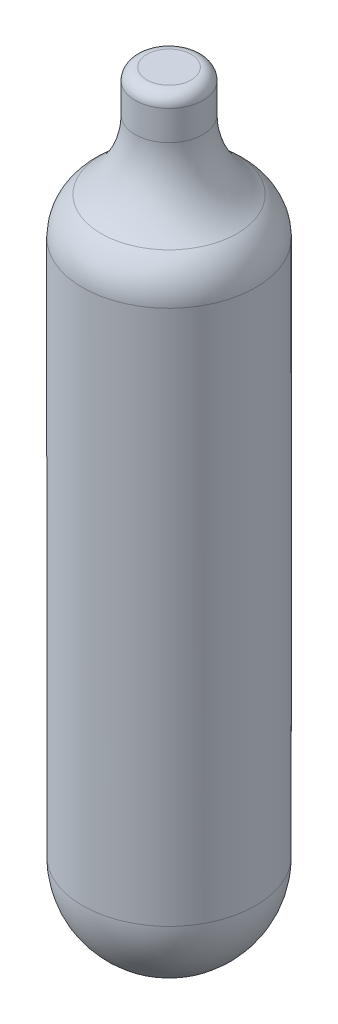
ISO-10303-21;
HEADER;
FILE_DESCRIPTION(('STEP AP214'),'2;1');
FILE_NAME('part.step','',(''),(''),'','','');
FILE_SCHEMA(('AUTOMOTIVE_DESIGN { 1 0 10303 214 1 1 1 1 }'));
ENDSEC;
DATA;
#1=APPLICATION_CONTEXT('core data for automotive mechanical design processes');
#2=APPLICATION_PROTOCOL_DEFINITION('international standard','automotive_design',2000,#1);
#3=PRODUCT_CONTEXT('',#1,'mechanical');
#4=PRODUCT('Part','Part','',(#3));
#5=PRODUCT_RELATED_PRODUCT_CATEGORY('part','',(#4));
#6=PRODUCT_DEFINITION_FORMATION('','',#4);
#7=PRODUCT_DEFINITION_CONTEXT('part definition',#1,'design');
#8=PRODUCT_DEFINITION('design','',#6,#7);
#9=PRODUCT_DEFINITION_SHAPE('','',#8);
#10=(LENGTH_UNIT() NAMED_UNIT(*) SI_UNIT(.MILLI.,.METRE.));
#11=(NAMED_UNIT(*) PLANE_ANGLE_UNIT() SI_UNIT($,.RADIAN.));
#12=(NAMED_UNIT(*) SI_UNIT($,.STERADIAN.) SOLID_ANGLE_UNIT());
#13=UNCERTAINTY_MEASURE_WITH_UNIT(LENGTH_MEASURE(1.E-05),#10,'distance_accuracy_value','');
#14=(GEOMETRIC_REPRESENTATION_CONTEXT(3) GLOBAL_UNCERTAINTY_ASSIGNED_CONTEXT((#13)) GLOBAL_UNIT_ASSIGNED_CONTEXT((#10,
#11,#12)) REPRESENTATION_CONTEXT('',''));
#15=CARTESIAN_POINT('',(0.,0.,0.));
#16=DIRECTION('',(0.,0.,1.));
#17=DIRECTION('',(1.,0.,0.));
#18=AXIS2_PLACEMENT_3D('',#15,#16,#17);
#19=CARTESIAN_POINT('',(0.,82.8802,0.));
#20=DIRECTION('',(0.,-1.,0.));
#21=DIRECTION('',(0.,0.,-1.));
#22=AXIS2_PLACEMENT_3D('',#19,#20,#21);
#23=CYLINDRICAL_SURFACE('',#22,9.3218);
#24=CARTESIAN_POINT('',(0.,66.9758447267499,0.));
#25=DIRECTION('',(0.,-1.,0.));
#26=DIRECTION('',(0.,0.,-1.));
#27=AXIS2_PLACEMENT_3D('',#24,#25,#26);
#28=CIRCLE('',#27,9.3218);
#29=CARTESIAN_POINT('',(0.,66.9758447267499,-9.3218));
#30=VERTEX_POINT('',#29);
#31=EDGE_CURVE('E42',#30,#30,#28,.T.);
#32=ORIENTED_EDGE('',*,*,#31,.T.);
#33=EDGE_LOOP('',(#32));
#34=FACE_BOUND('',#33,.T.);
#35=CARTESIAN_POINT('',(0.,9.3218,0.));
#36=DIRECTION('',(0.,-1.,0.));
#37=DIRECTION('',(0.,0.,-1.));
#38=AXIS2_PLACEMENT_3D('',#35,#36,#37);
#39=CIRCLE('',#38,9.3218);
#40=CARTESIAN_POINT('',(0.,9.3218,-9.3218));
#41=VERTEX_POINT('',#40);
#42=EDGE_CURVE('E54',#41,#41,#39,.F.);
#43=ORIENTED_EDGE('',*,*,#42,.T.);
#44=EDGE_LOOP('',(#43));
#45=FACE_BOUND('',#44,.T.);
#46=ADVANCED_FACE('F31',(#34,#45),#23,.T.);
#47=CARTESIAN_POINT('',(0.,9.3218,0.));
#48=DIRECTION('',(0.,1.,0.));
#49=DIRECTION('',(0.,0.,1.));
#50=AXIS2_PLACEMENT_3D('',#47,#48,#49);
#51=SPHERICAL_SURFACE('',#50,9.3218);
#52=ORIENTED_EDGE('',*,*,#42,.F.);
#53=EDGE_LOOP('',(#52));
#54=FACE_BOUND('',#53,.T.);
#55=ADVANCED_FACE('F59',(#54),#51,.T.);
#56=CARTESIAN_POINT('',(0.,69.85,0.));
#57=DIRECTION('',(0.,1.,0.));
#58=DIRECTION('',(0.,0.,1.));
#59=AXIS2_PLACEMENT_3D('',#56,#57,#58);
#60=CYLINDRICAL_SURFACE('',#59,3.6576);
#61=CARTESIAN_POINT('',(0.,81.6102,0.));
#62=DIRECTION('',(0.,1.,0.));
#63=DIRECTION('',(0.,0.,1.));
#64=AXIS2_PLACEMENT_3D('',#61,#62,#63);
#65=CIRCLE('',#64,3.6576);
#66=CARTESIAN_POINT('',(0.,81.6102,3.6576));
#67=VERTEX_POINT('',#66);
#68=EDGE_CURVE('E10',#67,#67,#65,.F.);
#69=ORIENTED_EDGE('',*,*,#68,.T.);
#70=EDGE_LOOP('',(#69));
#71=FACE_BOUND('',#70,.T.);
#72=CARTESIAN_POINT('',(0.,78.4242590047187,0.));
#73=DIRECTION('',(0.,-1.,0.));
#74=DIRECTION('',(0.,0.,-1.));
#75=AXIS2_PLACEMENT_3D('',#72,#73,#74);
#76=CIRCLE('',#75,3.6576);
#77=CARTESIAN_POINT('',(0.,78.4242590047187,-3.6576));
#78=VERTEX_POINT('',#77);
#79=EDGE_CURVE('E51',#78,#78,#76,.F.);
#80=ORIENTED_EDGE('',*,*,#79,.T.);
#81=EDGE_LOOP('',(#80));
#82=FACE_BOUND('',#81,.T.);
#83=ADVANCED_FACE('F61',(#71,#82),#60,.T.);
#84=CARTESIAN_POINT('',(0.,82.8802,0.));
#85=DIRECTION('',(0.,1.,0.));
#86=DIRECTION('',(0.,0.,1.));
#87=AXIS2_PLACEMENT_3D('',#84,#85,#86);
#88=PLANE('',#87);
#89=CARTESIAN_POINT('',(0.,82.8802,0.));
#90=DIRECTION('',(0.,1.,0.));
#91=DIRECTION('',(0.,0.,1.));
#92=AXIS2_PLACEMENT_3D('',#89,#90,#91);
#93=CIRCLE('',#92,2.3876);
#94=CARTESIAN_POINT('',(0.,82.8802,2.3876));
#95=VERTEX_POINT('',#94);
#96=EDGE_CURVE('E38',#95,#95,#93,.T.);
#97=ORIENTED_EDGE('',*,*,#96,.T.);
#98=EDGE_LOOP('',(#97));
#99=FACE_BOUND('',#98,.T.);
#100=ADVANCED_FACE('F67',(#99),#88,.T.);
#101=CARTESIAN_POINT('',(0.,78.4242590047187,0.));
#102=DIRECTION('',(0.,-1.,0.));
#103=DIRECTION('',(0.,0.,-1.));
#104=AXIS2_PLACEMENT_3D('',#101,#102,#103);
#105=TOROIDAL_SURFACE('',#104,12.9794,9.3218);
#106=CARTESIAN_POINT('',(0.,71.0140860946401,0.));
#107=DIRECTION('',(0.,1.,0.));
#108=DIRECTION('',(0.,0.,1.));
#109=AXIS2_PLACEMENT_3D('',#106,#107,#108);
#110=CIRCLE('',#109,7.32384585537919);
#111=CARTESIAN_POINT('',(0.,71.0140860946401,7.32384585537919));
#112=VERTEX_POINT('',#111);
#113=EDGE_CURVE('E46',#112,#112,#110,.T.);
#114=ORIENTED_EDGE('',*,*,#113,.T.);
#115=EDGE_LOOP('',(#114));
#116=FACE_BOUND('',#115,.T.);
#117=ORIENTED_EDGE('',*,*,#79,.F.);
#118=EDGE_LOOP('',(#117));
#119=FACE_BOUND('',#118,.T.);
#120=ADVANCED_FACE('F73',(#116,#119),#105,.F.);
#121=CARTESIAN_POINT('',(0.,66.9758447267499,0.));
#122=DIRECTION('',(0.,-1.,0.));
#123=DIRECTION('',(0.,0.,-1.));
#124=AXIS2_PLACEMENT_3D('',#121,#122,#123);
#125=DEGENERATE_TOROIDAL_SURFACE('',#124,4.2418,5.08,.T.);
#126=ORIENTED_EDGE('',*,*,#31,.F.);
#127=EDGE_LOOP('',(#126));
#128=FACE_BOUND('',#127,.T.);
#129=ORIENTED_EDGE('',*,*,#113,.F.);
#130=EDGE_LOOP('',(#129));
#131=FACE_BOUND('',#130,.T.);
#132=ADVANCED_FACE('F75',(#128,#131),#125,.T.);
#133=CARTESIAN_POINT('',(0.,81.6102,0.));
#134=DIRECTION('',(0.,1.,0.));
#135=DIRECTION('',(0.,0.,1.));
#136=AXIS2_PLACEMENT_3D('',#133,#134,#135);
#137=TOROIDAL_SURFACE('',#136,2.3876,1.27);
#138=ORIENTED_EDGE('',*,*,#68,.F.);
#139=EDGE_LOOP('',(#138));
#140=FACE_BOUND('',#139,.T.);
#141=ORIENTED_EDGE('',*,*,#96,.F.);
#142=EDGE_LOOP('',(#141));
#143=FACE_BOUND('',#142,.T.);
#144=ADVANCED_FACE('F33',(#140,#143),#137,.T.);
#145=CLOSED_SHELL('',(#46,#55,#83,#100,#120,#132,#144));
#146=MANIFOLD_SOLID_BREP('B2',#145);
#147=ADVANCED_BREP_SHAPE_REPRESENTATION('',(#18,#146),#14);
#148=SHAPE_DEFINITION_REPRESENTATION(#9,#147);
ENDSEC;
END-ISO-10303-21;
